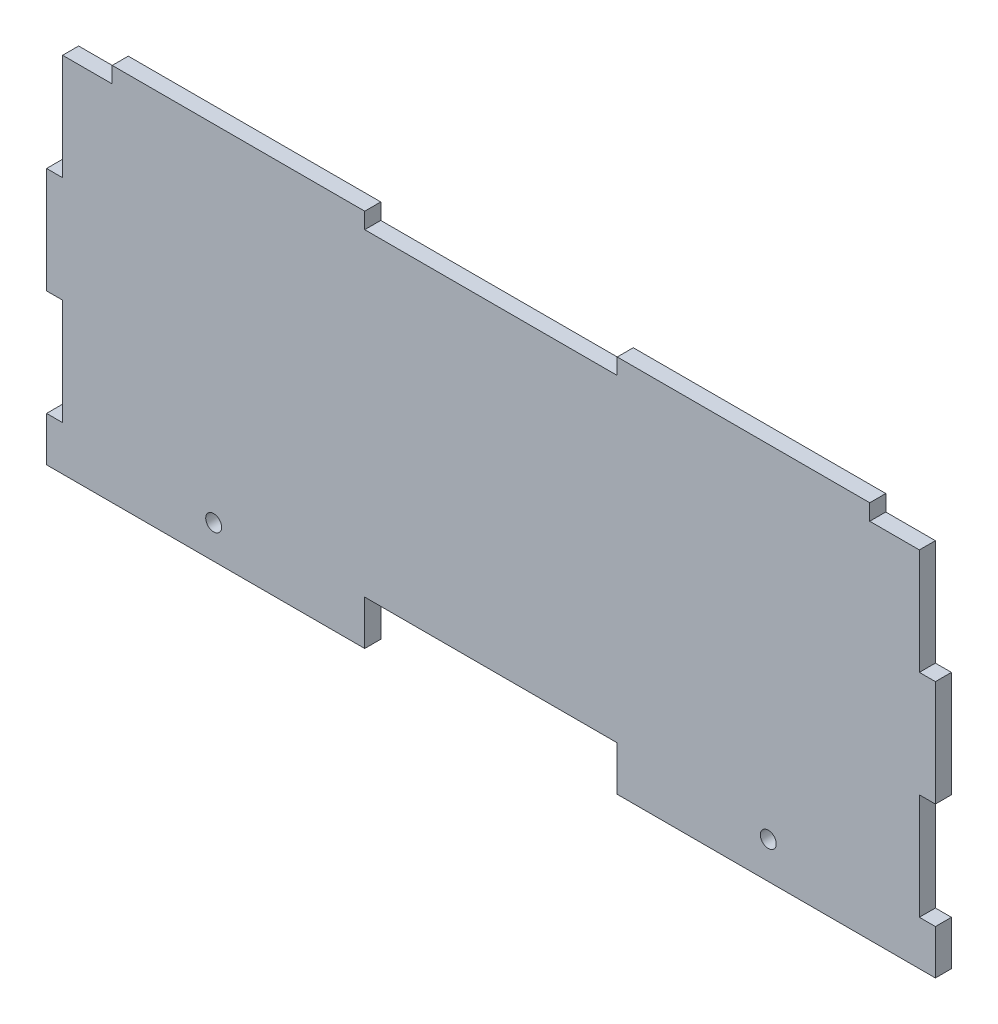
ISO-10303-21;
HEADER;
FILE_DESCRIPTION(('STEP AP214'),'2;1');
FILE_NAME('part.step','',(''),(''),'','','');
FILE_SCHEMA(('AUTOMOTIVE_DESIGN { 1 0 10303 214 1 1 1 1 }'));
ENDSEC;
DATA;
#1=APPLICATION_CONTEXT('core data for automotive mechanical design processes');
#2=APPLICATION_PROTOCOL_DEFINITION('international standard','automotive_design',2000,#1);
#3=PRODUCT_CONTEXT('',#1,'mechanical');
#4=PRODUCT('Part','Part','',(#3));
#5=PRODUCT_RELATED_PRODUCT_CATEGORY('part','',(#4));
#6=PRODUCT_DEFINITION_FORMATION('','',#4);
#7=PRODUCT_DEFINITION_CONTEXT('part definition',#1,'design');
#8=PRODUCT_DEFINITION('design','',#6,#7);
#9=PRODUCT_DEFINITION_SHAPE('','',#8);
#10=(LENGTH_UNIT() NAMED_UNIT(*) SI_UNIT(.MILLI.,.METRE.));
#11=(NAMED_UNIT(*) PLANE_ANGLE_UNIT() SI_UNIT($,.RADIAN.));
#12=(NAMED_UNIT(*) SI_UNIT($,.STERADIAN.) SOLID_ANGLE_UNIT());
#13=UNCERTAINTY_MEASURE_WITH_UNIT(LENGTH_MEASURE(1.E-05),#10,'distance_accuracy_value','');
#14=(GEOMETRIC_REPRESENTATION_CONTEXT(3) GLOBAL_UNCERTAINTY_ASSIGNED_CONTEXT((#13)) GLOBAL_UNIT_ASSIGNED_CONTEXT((#10,
#11,#12)) REPRESENTATION_CONTEXT('',''));
#15=CARTESIAN_POINT('',(0.,0.,0.));
#16=DIRECTION('',(0.,0.,1.));
#17=DIRECTION('',(1.,0.,0.));
#18=AXIS2_PLACEMENT_3D('',#15,#16,#17);
#19=CARTESIAN_POINT('',(172.825,0.,1.5875));
#20=DIRECTION('',(1.,0.,0.));
#21=DIRECTION('',(0.,0.,-1.));
#22=AXIS2_PLACEMENT_3D('',#19,#20,#21);
#23=PLANE('',#22);
#24=DIRECTION('',(0.,-1.,0.));
#25=VECTOR('',#24,1.);
#26=CARTESIAN_POINT('',(172.825,0.,-1.5875));
#27=LINE('',#26,#25);
#28=CARTESIAN_POINT('',(172.825,29.825,-1.5875));
#29=VERTEX_POINT('',#28);
#30=CARTESIAN_POINT('',(172.825,8.82499999999999,-1.5875));
#31=VERTEX_POINT('',#30);
#32=EDGE_CURVE('E343',#29,#31,#27,.T.);
#33=ORIENTED_EDGE('',*,*,#32,.F.);
#34=DIRECTION('',(0.,0.,-1.));
#35=VECTOR('',#34,1.);
#36=CARTESIAN_POINT('',(172.825,29.825,1.5875));
#37=LINE('',#36,#35);
#38=CARTESIAN_POINT('',(172.825,29.825,1.5875));
#39=VERTEX_POINT('',#38);
#40=EDGE_CURVE('E11',#39,#29,#37,.T.);
#41=ORIENTED_EDGE('',*,*,#40,.F.);
#42=DIRECTION('',(0.,-1.,0.));
#43=VECTOR('',#42,1.);
#44=CARTESIAN_POINT('',(172.825,0.,1.5875));
#45=LINE('',#44,#43);
#46=CARTESIAN_POINT('',(172.825,8.82499999999999,1.5875));
#47=VERTEX_POINT('',#46);
#48=EDGE_CURVE('E259',#39,#47,#45,.T.);
#49=ORIENTED_EDGE('',*,*,#48,.T.);
#50=DIRECTION('',(0.,0.,-1.));
#51=VECTOR('',#50,1.);
#52=CARTESIAN_POINT('',(172.825,8.82499999999999,1.5875));
#53=LINE('',#52,#51);
#54=EDGE_CURVE('E146',#47,#31,#53,.T.);
#55=ORIENTED_EDGE('',*,*,#54,.T.);
#56=EDGE_LOOP('',(#33,#41,#49,#55));
#57=FACE_BOUND('',#56,.T.);
#58=ADVANCED_FACE('F35',(#57),#23,.T.);
#59=CARTESIAN_POINT('',(0.,29.825,1.5875));
#60=DIRECTION('',(0.,1.,0.));
#61=DIRECTION('',(0.,0.,1.));
#62=AXIS2_PLACEMENT_3D('',#59,#60,#61);
#63=PLANE('',#62);
#64=DIRECTION('',(1.,0.,0.));
#65=VECTOR('',#64,1.);
#66=CARTESIAN_POINT('',(0.,29.825,-1.5875));
#67=LINE('',#66,#65);
#68=CARTESIAN_POINT('',(176.,29.825,-1.5875));
#69=VERTEX_POINT('',#68);
#70=EDGE_CURVE('E340',#29,#69,#67,.T.);
#71=ORIENTED_EDGE('',*,*,#70,.T.);
#72=DIRECTION('',(0.,0.,-1.));
#73=VECTOR('',#72,1.);
#74=CARTESIAN_POINT('',(176.,29.825,1.5875));
#75=LINE('',#74,#73);
#76=CARTESIAN_POINT('',(176.,29.825,1.5875));
#77=VERTEX_POINT('',#76);
#78=EDGE_CURVE('E44',#77,#69,#75,.T.);
#79=ORIENTED_EDGE('',*,*,#78,.F.);
#80=DIRECTION('',(1.,0.,0.));
#81=VECTOR('',#80,1.);
#82=CARTESIAN_POINT('',(0.,29.825,1.5875));
#83=LINE('',#82,#81);
#84=EDGE_CURVE('E254',#39,#77,#83,.T.);
#85=ORIENTED_EDGE('',*,*,#84,.F.);
#86=ORIENTED_EDGE('',*,*,#40,.T.);
#87=EDGE_LOOP('',(#71,#79,#85,#86));
#88=FACE_BOUND('',#87,.T.);
#89=ADVANCED_FACE('F341',(#88),#63,.F.);
#90=CARTESIAN_POINT('',(176.,0.,1.5875));
#91=DIRECTION('',(1.,0.,0.));
#92=DIRECTION('',(0.,0.,-1.));
#93=AXIS2_PLACEMENT_3D('',#90,#91,#92);
#94=PLANE('',#93);
#95=DIRECTION('',(0.,-1.,0.));
#96=VECTOR('',#95,1.);
#97=CARTESIAN_POINT('',(176.,0.,-1.5875));
#98=LINE('',#97,#96);
#99=CARTESIAN_POINT('',(176.,50.825,-1.5875));
#100=VERTEX_POINT('',#99);
#101=EDGE_CURVE('E275',#100,#69,#98,.T.);
#102=ORIENTED_EDGE('',*,*,#101,.F.);
#103=DIRECTION('',(0.,0.,-1.));
#104=VECTOR('',#103,1.);
#105=CARTESIAN_POINT('',(176.,50.825,1.5875));
#106=LINE('',#105,#104);
#107=CARTESIAN_POINT('',(176.,50.825,1.5875));
#108=VERTEX_POINT('',#107);
#109=EDGE_CURVE('E332',#108,#100,#106,.T.);
#110=ORIENTED_EDGE('',*,*,#109,.F.);
#111=DIRECTION('',(0.,-1.,0.));
#112=VECTOR('',#111,1.);
#113=CARTESIAN_POINT('',(176.,0.,1.5875));
#114=LINE('',#113,#112);
#115=EDGE_CURVE('E248',#108,#77,#114,.T.);
#116=ORIENTED_EDGE('',*,*,#115,.T.);
#117=ORIENTED_EDGE('',*,*,#78,.T.);
#118=EDGE_LOOP('',(#102,#110,#116,#117));
#119=FACE_BOUND('',#118,.T.);
#120=ADVANCED_FACE('F335',(#119),#94,.T.);
#121=CARTESIAN_POINT('',(0.,50.825,1.5875));
#122=DIRECTION('',(0.,1.,0.));
#123=DIRECTION('',(0.,0.,1.));
#124=AXIS2_PLACEMENT_3D('',#121,#122,#123);
#125=PLANE('',#124);
#126=DIRECTION('',(1.,0.,0.));
#127=VECTOR('',#126,1.);
#128=CARTESIAN_POINT('',(0.,50.825,-1.5875));
#129=LINE('',#128,#127);
#130=CARTESIAN_POINT('',(172.825,50.825,-1.5875));
#131=VERTEX_POINT('',#130);
#132=EDGE_CURVE('E348',#131,#100,#129,.T.);
#133=ORIENTED_EDGE('',*,*,#132,.F.);
#134=DIRECTION('',(0.,0.,-1.));
#135=VECTOR('',#134,1.);
#136=CARTESIAN_POINT('',(172.825,50.825,1.5875));
#137=LINE('',#136,#135);
#138=CARTESIAN_POINT('',(172.825,50.825,1.5875));
#139=VERTEX_POINT('',#138);
#140=EDGE_CURVE('E330',#139,#131,#137,.T.);
#141=ORIENTED_EDGE('',*,*,#140,.F.);
#142=DIRECTION('',(1.,0.,0.));
#143=VECTOR('',#142,1.);
#144=CARTESIAN_POINT('',(0.,50.825,1.5875));
#145=LINE('',#144,#143);
#146=EDGE_CURVE('E253',#139,#108,#145,.T.);
#147=ORIENTED_EDGE('',*,*,#146,.T.);
#148=ORIENTED_EDGE('',*,*,#109,.T.);
#149=EDGE_LOOP('',(#133,#141,#147,#148));
#150=FACE_BOUND('',#149,.T.);
#151=ADVANCED_FACE('F517',(#150),#125,.T.);
#152=CARTESIAN_POINT('',(172.825,0.,1.5875));
#153=DIRECTION('',(-1.,0.,0.));
#154=DIRECTION('',(0.,0.,1.));
#155=AXIS2_PLACEMENT_3D('',#152,#153,#154);
#156=PLANE('',#155);
#157=DIRECTION('',(0.,1.,0.));
#158=VECTOR('',#157,1.);
#159=CARTESIAN_POINT('',(172.825,0.,-1.5875));
#160=LINE('',#159,#158);
#161=CARTESIAN_POINT('',(172.825,71.825,-1.5875));
#162=VERTEX_POINT('',#161);
#163=EDGE_CURVE('E349',#131,#162,#160,.T.);
#164=ORIENTED_EDGE('',*,*,#163,.T.);
#165=DIRECTION('',(0.,0.,-1.));
#166=VECTOR('',#165,1.);
#167=CARTESIAN_POINT('',(172.825,71.825,1.5875));
#168=LINE('',#167,#166);
#169=CARTESIAN_POINT('',(172.825,71.825,1.5875));
#170=VERTEX_POINT('',#169);
#171=EDGE_CURVE('E327',#170,#162,#168,.T.);
#172=ORIENTED_EDGE('',*,*,#171,.F.);
#173=DIRECTION('',(0.,1.,0.));
#174=VECTOR('',#173,1.);
#175=CARTESIAN_POINT('',(172.825,0.,1.5875));
#176=LINE('',#175,#174);
#177=EDGE_CURVE('E258',#139,#170,#176,.T.);
#178=ORIENTED_EDGE('',*,*,#177,.F.);
#179=ORIENTED_EDGE('',*,*,#140,.T.);
#180=EDGE_LOOP('',(#164,#172,#178,#179));
#181=FACE_BOUND('',#180,.T.);
#182=ADVANCED_FACE('F514',(#181),#156,.F.);
#183=CARTESIAN_POINT('',(0.,71.825,1.5875));
#184=DIRECTION('',(0.,-1.,0.));
#185=DIRECTION('',(0.,0.,-1.));
#186=AXIS2_PLACEMENT_3D('',#183,#184,#185);
#187=PLANE('',#186);
#188=DIRECTION('',(-1.,0.,0.));
#189=VECTOR('',#188,1.);
#190=CARTESIAN_POINT('',(0.,71.825,-1.5875));
#191=LINE('',#190,#189);
#192=CARTESIAN_POINT('',(163.,71.825,-1.5875));
#193=VERTEX_POINT('',#192);
#194=EDGE_CURVE('E355',#162,#193,#191,.T.);
#195=ORIENTED_EDGE('',*,*,#194,.T.);
#196=DIRECTION('',(0.,0.,-1.));
#197=VECTOR('',#196,1.);
#198=CARTESIAN_POINT('',(163.,71.825,1.5875));
#199=LINE('',#198,#197);
#200=CARTESIAN_POINT('',(163.,71.825,1.5875));
#201=VERTEX_POINT('',#200);
#202=EDGE_CURVE('E325',#201,#193,#199,.T.);
#203=ORIENTED_EDGE('',*,*,#202,.F.);
#204=DIRECTION('',(-1.,0.,0.));
#205=VECTOR('',#204,1.);
#206=CARTESIAN_POINT('',(0.,71.825,1.5875));
#207=LINE('',#206,#205);
#208=EDGE_CURVE('E510',#170,#201,#207,.T.);
#209=ORIENTED_EDGE('',*,*,#208,.F.);
#210=ORIENTED_EDGE('',*,*,#171,.T.);
#211=EDGE_LOOP('',(#195,#203,#209,#210));
#212=FACE_BOUND('',#211,.T.);
#213=ADVANCED_FACE('F509',(#212),#187,.F.);
#214=CARTESIAN_POINT('',(163.,0.,1.5875));
#215=DIRECTION('',(1.,0.,0.));
#216=DIRECTION('',(0.,0.,-1.));
#217=AXIS2_PLACEMENT_3D('',#214,#215,#216);
#218=PLANE('',#217);
#219=DIRECTION('',(0.,-1.,0.));
#220=VECTOR('',#219,1.);
#221=CARTESIAN_POINT('',(163.,0.,-1.5875));
#222=LINE('',#221,#220);
#223=CARTESIAN_POINT('',(163.,75.,-1.5875));
#224=VERTEX_POINT('',#223);
#225=EDGE_CURVE('E358',#224,#193,#222,.T.);
#226=ORIENTED_EDGE('',*,*,#225,.F.);
#227=DIRECTION('',(0.,0.,-1.));
#228=VECTOR('',#227,1.);
#229=CARTESIAN_POINT('',(163.,75.,1.5875));
#230=LINE('',#229,#228);
#231=CARTESIAN_POINT('',(163.,75.,1.5875));
#232=VERTEX_POINT('',#231);
#233=EDGE_CURVE('E323',#232,#224,#230,.T.);
#234=ORIENTED_EDGE('',*,*,#233,.F.);
#235=DIRECTION('',(0.,-1.,0.));
#236=VECTOR('',#235,1.);
#237=CARTESIAN_POINT('',(163.,0.,1.5875));
#238=LINE('',#237,#236);
#239=EDGE_CURVE('E505',#232,#201,#238,.T.);
#240=ORIENTED_EDGE('',*,*,#239,.T.);
#241=ORIENTED_EDGE('',*,*,#202,.T.);
#242=EDGE_LOOP('',(#226,#234,#240,#241));
#243=FACE_BOUND('',#242,.T.);
#244=ADVANCED_FACE('F504',(#243),#218,.T.);
#245=CARTESIAN_POINT('',(0.,75.,1.5875));
#246=DIRECTION('',(0.,-1.,0.));
#247=DIRECTION('',(1.,0.,0.));
#248=AXIS2_PLACEMENT_3D('',#245,#246,#247);
#249=PLANE('',#248);
#250=DIRECTION('',(-1.,0.,0.));
#251=VECTOR('',#250,1.);
#252=CARTESIAN_POINT('',(0.,75.,-1.5875));
#253=LINE('',#252,#251);
#254=CARTESIAN_POINT('',(113.,75.,-1.5875));
#255=VERTEX_POINT('',#254);
#256=EDGE_CURVE('E361',#224,#255,#253,.T.);
#257=ORIENTED_EDGE('',*,*,#256,.T.);
#258=DIRECTION('',(0.,0.,-1.));
#259=VECTOR('',#258,1.);
#260=CARTESIAN_POINT('',(113.,75.,1.5875));
#261=LINE('',#260,#259);
#262=CARTESIAN_POINT('',(113.,75.,1.5875));
#263=VERTEX_POINT('',#262);
#264=EDGE_CURVE('E321',#263,#255,#261,.T.);
#265=ORIENTED_EDGE('',*,*,#264,.F.);
#266=DIRECTION('',(-1.,0.,0.));
#267=VECTOR('',#266,1.);
#268=CARTESIAN_POINT('',(0.,75.,1.5875));
#269=LINE('',#268,#267);
#270=EDGE_CURVE('E500',#232,#263,#269,.T.);
#271=ORIENTED_EDGE('',*,*,#270,.F.);
#272=ORIENTED_EDGE('',*,*,#233,.T.);
#273=EDGE_LOOP('',(#257,#265,#271,#272));
#274=FACE_BOUND('',#273,.T.);
#275=ADVANCED_FACE('F499',(#274),#249,.F.);
#276=CARTESIAN_POINT('',(113.,0.,1.5875));
#277=DIRECTION('',(-1.,0.,0.));
#278=DIRECTION('',(0.,0.,1.));
#279=AXIS2_PLACEMENT_3D('',#276,#277,#278);
#280=PLANE('',#279);
#281=DIRECTION('',(0.,1.,0.));
#282=VECTOR('',#281,1.);
#283=CARTESIAN_POINT('',(113.,0.,-1.5875));
#284=LINE('',#283,#282);
#285=CARTESIAN_POINT('',(113.,71.825,-1.5875));
#286=VERTEX_POINT('',#285);
#287=EDGE_CURVE('E364',#286,#255,#284,.T.);
#288=ORIENTED_EDGE('',*,*,#287,.F.);
#289=DIRECTION('',(0.,0.,-1.));
#290=VECTOR('',#289,1.);
#291=CARTESIAN_POINT('',(113.,71.825,1.5875));
#292=LINE('',#291,#290);
#293=CARTESIAN_POINT('',(113.,71.825,1.5875));
#294=VERTEX_POINT('',#293);
#295=EDGE_CURVE('E319',#294,#286,#292,.T.);
#296=ORIENTED_EDGE('',*,*,#295,.F.);
#297=DIRECTION('',(0.,1.,0.));
#298=VECTOR('',#297,1.);
#299=CARTESIAN_POINT('',(113.,0.,1.5875));
#300=LINE('',#299,#298);
#301=EDGE_CURVE('E496',#294,#263,#300,.T.);
#302=ORIENTED_EDGE('',*,*,#301,.T.);
#303=ORIENTED_EDGE('',*,*,#264,.T.);
#304=EDGE_LOOP('',(#288,#296,#302,#303));
#305=FACE_BOUND('',#304,.T.);
#306=ADVANCED_FACE('F492',(#305),#280,.T.);
#307=CARTESIAN_POINT('',(0.,71.825,1.5875));
#308=DIRECTION('',(0.,1.,0.));
#309=DIRECTION('',(0.,0.,1.));
#310=AXIS2_PLACEMENT_3D('',#307,#308,#309);
#311=PLANE('',#310);
#312=DIRECTION('',(1.,0.,0.));
#313=VECTOR('',#312,1.);
#314=CARTESIAN_POINT('',(0.,71.825,-1.5875));
#315=LINE('',#314,#313);
#316=CARTESIAN_POINT('',(63.,71.825,-1.5875));
#317=VERTEX_POINT('',#316);
#318=EDGE_CURVE('E368',#317,#286,#315,.T.);
#319=ORIENTED_EDGE('',*,*,#318,.F.);
#320=DIRECTION('',(0.,0.,-1.));
#321=VECTOR('',#320,1.);
#322=CARTESIAN_POINT('',(63.,71.825,1.5875));
#323=LINE('',#322,#321);
#324=CARTESIAN_POINT('',(63.,71.825,1.5875));
#325=VERTEX_POINT('',#324);
#326=EDGE_CURVE('E317',#325,#317,#323,.T.);
#327=ORIENTED_EDGE('',*,*,#326,.F.);
#328=DIRECTION('',(1.,0.,0.));
#329=VECTOR('',#328,1.);
#330=CARTESIAN_POINT('',(0.,71.825,1.5875));
#331=LINE('',#330,#329);
#332=EDGE_CURVE('E525',#325,#294,#331,.T.);
#333=ORIENTED_EDGE('',*,*,#332,.T.);
#334=ORIENTED_EDGE('',*,*,#295,.T.);
#335=EDGE_LOOP('',(#319,#327,#333,#334));
#336=FACE_BOUND('',#335,.T.);
#337=ADVANCED_FACE('F487',(#336),#311,.T.);
#338=CARTESIAN_POINT('',(63.,0.,1.5875));
#339=DIRECTION('',(1.,0.,0.));
#340=DIRECTION('',(0.,0.,-1.));
#341=AXIS2_PLACEMENT_3D('',#338,#339,#340);
#342=PLANE('',#341);
#343=DIRECTION('',(0.,-1.,0.));
#344=VECTOR('',#343,1.);
#345=CARTESIAN_POINT('',(63.,0.,-1.5875));
#346=LINE('',#345,#344);
#347=CARTESIAN_POINT('',(63.,75.,-1.5875));
#348=VERTEX_POINT('',#347);
#349=EDGE_CURVE('E371',#348,#317,#346,.T.);
#350=ORIENTED_EDGE('',*,*,#349,.F.);
#351=DIRECTION('',(0.,0.,-1.));
#352=VECTOR('',#351,1.);
#353=CARTESIAN_POINT('',(63.,75.,1.5875));
#354=LINE('',#353,#352);
#355=CARTESIAN_POINT('',(63.,75.,1.5875));
#356=VERTEX_POINT('',#355);
#357=EDGE_CURVE('E315',#356,#348,#354,.T.);
#358=ORIENTED_EDGE('',*,*,#357,.F.);
#359=DIRECTION('',(0.,-1.,0.));
#360=VECTOR('',#359,1.);
#361=CARTESIAN_POINT('',(63.,0.,1.5875));
#362=LINE('',#361,#360);
#363=EDGE_CURVE('E483',#356,#325,#362,.T.);
#364=ORIENTED_EDGE('',*,*,#363,.T.);
#365=ORIENTED_EDGE('',*,*,#326,.T.);
#366=EDGE_LOOP('',(#350,#358,#364,#365));
#367=FACE_BOUND('',#366,.T.);
#368=ADVANCED_FACE('F479',(#367),#342,.T.);
#369=CARTESIAN_POINT('',(13.,75.,-1.5875));
#370=VERTEX_POINT('',#369);
#371=EDGE_CURVE('E365',#348,#370,#253,.T.);
#372=ORIENTED_EDGE('',*,*,#371,.T.);
#373=DIRECTION('',(0.,0.,-1.));
#374=VECTOR('',#373,1.);
#375=CARTESIAN_POINT('',(13.,75.,1.5875));
#376=LINE('',#375,#374);
#377=CARTESIAN_POINT('',(13.,75.,1.5875));
#378=VERTEX_POINT('',#377);
#379=EDGE_CURVE('E312',#378,#370,#376,.T.);
#380=ORIENTED_EDGE('',*,*,#379,.F.);
#381=EDGE_CURVE('E523',#356,#378,#269,.T.);
#382=ORIENTED_EDGE('',*,*,#381,.F.);
#383=ORIENTED_EDGE('',*,*,#357,.T.);
#384=EDGE_LOOP('',(#372,#380,#382,#383));
#385=FACE_BOUND('',#384,.T.);
#386=ADVANCED_FACE('F476',(#385),#249,.F.);
#387=CARTESIAN_POINT('',(13.,0.,1.5875));
#388=DIRECTION('',(1.,0.,0.));
#389=DIRECTION('',(0.,1.,0.));
#390=AXIS2_PLACEMENT_3D('',#387,#388,#389);
#391=PLANE('',#390);
#392=DIRECTION('',(0.,-1.,0.));
#393=VECTOR('',#392,1.);
#394=CARTESIAN_POINT('',(13.,0.,-1.5875));
#395=LINE('',#394,#393);
#396=CARTESIAN_POINT('',(13.,71.825,-1.5875));
#397=VERTEX_POINT('',#396);
#398=EDGE_CURVE('E374',#370,#397,#395,.T.);
#399=ORIENTED_EDGE('',*,*,#398,.T.);
#400=DIRECTION('',(0.,0.,-1.));
#401=VECTOR('',#400,1.);
#402=CARTESIAN_POINT('',(13.,71.825,1.5875));
#403=LINE('',#402,#401);
#404=CARTESIAN_POINT('',(13.,71.825,1.5875));
#405=VERTEX_POINT('',#404);
#406=EDGE_CURVE('E310',#405,#397,#403,.T.);
#407=ORIENTED_EDGE('',*,*,#406,.F.);
#408=DIRECTION('',(0.,-1.,0.));
#409=VECTOR('',#408,1.);
#410=CARTESIAN_POINT('',(13.,0.,1.5875));
#411=LINE('',#410,#409);
#412=EDGE_CURVE('E472',#378,#405,#411,.T.);
#413=ORIENTED_EDGE('',*,*,#412,.F.);
#414=ORIENTED_EDGE('',*,*,#379,.T.);
#415=EDGE_LOOP('',(#399,#407,#413,#414));
#416=FACE_BOUND('',#415,.T.);
#417=ADVANCED_FACE('F469',(#416),#391,.F.);
#418=CARTESIAN_POINT('',(0.,71.825,1.5875));
#419=DIRECTION('',(0.,1.,0.));
#420=DIRECTION('',(0.,0.,1.));
#421=AXIS2_PLACEMENT_3D('',#418,#419,#420);
#422=PLANE('',#421);
#423=DIRECTION('',(1.,0.,0.));
#424=VECTOR('',#423,1.);
#425=CARTESIAN_POINT('',(0.,71.825,-1.5875));
#426=LINE('',#425,#424);
#427=CARTESIAN_POINT('',(3.175,71.825,-1.5875));
#428=VERTEX_POINT('',#427);
#429=EDGE_CURVE('E377',#428,#397,#426,.T.);
#430=ORIENTED_EDGE('',*,*,#429,.F.);
#431=DIRECTION('',(0.,0.,-1.));
#432=VECTOR('',#431,1.);
#433=CARTESIAN_POINT('',(3.175,71.825,1.5875));
#434=LINE('',#433,#432);
#435=CARTESIAN_POINT('',(3.175,71.825,1.5875));
#436=VERTEX_POINT('',#435);
#437=EDGE_CURVE('E308',#436,#428,#434,.T.);
#438=ORIENTED_EDGE('',*,*,#437,.F.);
#439=DIRECTION('',(1.,0.,0.));
#440=VECTOR('',#439,1.);
#441=CARTESIAN_POINT('',(0.,71.825,1.5875));
#442=LINE('',#441,#440);
#443=EDGE_CURVE('E467',#436,#405,#442,.T.);
#444=ORIENTED_EDGE('',*,*,#443,.T.);
#445=ORIENTED_EDGE('',*,*,#406,.T.);
#446=EDGE_LOOP('',(#430,#438,#444,#445));
#447=FACE_BOUND('',#446,.T.);
#448=ADVANCED_FACE('F463',(#447),#422,.T.);
#449=CARTESIAN_POINT('',(3.17500000000001,0.,1.5875));
#450=DIRECTION('',(-1.,0.,0.));
#451=DIRECTION('',(0.,-1.,0.));
#452=AXIS2_PLACEMENT_3D('',#449,#450,#451);
#453=PLANE('',#452);
#454=DIRECTION('',(0.,1.,0.));
#455=VECTOR('',#454,1.);
#456=CARTESIAN_POINT('',(3.17500000000001,0.,-1.5875));
#457=LINE('',#456,#455);
#458=CARTESIAN_POINT('',(3.175,50.825,-1.5875));
#459=VERTEX_POINT('',#458);
#460=EDGE_CURVE('E380',#459,#428,#457,.T.);
#461=ORIENTED_EDGE('',*,*,#460,.F.);
#462=DIRECTION('',(0.,0.,-1.));
#463=VECTOR('',#462,1.);
#464=CARTESIAN_POINT('',(3.175,50.825,1.5875));
#465=LINE('',#464,#463);
#466=CARTESIAN_POINT('',(3.175,50.825,1.5875));
#467=VERTEX_POINT('',#466);
#468=EDGE_CURVE('E306',#467,#459,#465,.T.);
#469=ORIENTED_EDGE('',*,*,#468,.F.);
#470=DIRECTION('',(0.,1.,0.));
#471=VECTOR('',#470,1.);
#472=CARTESIAN_POINT('',(3.17500000000001,0.,1.5875));
#473=LINE('',#472,#471);
#474=EDGE_CURVE('E530',#467,#436,#473,.T.);
#475=ORIENTED_EDGE('',*,*,#474,.T.);
#476=ORIENTED_EDGE('',*,*,#437,.T.);
#477=EDGE_LOOP('',(#461,#469,#475,#476));
#478=FACE_BOUND('',#477,.T.);
#479=ADVANCED_FACE('F459',(#478),#453,.T.);
#480=CARTESIAN_POINT('',(0.,50.825,1.5875));
#481=DIRECTION('',(0.,1.,0.));
#482=DIRECTION('',(0.,0.,1.));
#483=AXIS2_PLACEMENT_3D('',#480,#481,#482);
#484=PLANE('',#483);
#485=DIRECTION('',(1.,0.,0.));
#486=VECTOR('',#485,1.);
#487=CARTESIAN_POINT('',(0.,50.825,-1.5875));
#488=LINE('',#487,#486);
#489=CARTESIAN_POINT('',(0.,50.825,-1.5875));
#490=VERTEX_POINT('',#489);
#491=EDGE_CURVE('E383',#490,#459,#488,.T.);
#492=ORIENTED_EDGE('',*,*,#491,.F.);
#493=DIRECTION('',(0.,0.,-1.));
#494=VECTOR('',#493,1.);
#495=CARTESIAN_POINT('',(0.,50.825,1.5875));
#496=LINE('',#495,#494);
#497=CARTESIAN_POINT('',(0.,50.825,1.5875));
#498=VERTEX_POINT('',#497);
#499=EDGE_CURVE('E304',#498,#490,#496,.T.);
#500=ORIENTED_EDGE('',*,*,#499,.F.);
#501=DIRECTION('',(1.,0.,0.));
#502=VECTOR('',#501,1.);
#503=CARTESIAN_POINT('',(0.,50.825,1.5875));
#504=LINE('',#503,#502);
#505=EDGE_CURVE('E455',#498,#467,#504,.T.);
#506=ORIENTED_EDGE('',*,*,#505,.T.);
#507=ORIENTED_EDGE('',*,*,#468,.T.);
#508=EDGE_LOOP('',(#492,#500,#506,#507));
#509=FACE_BOUND('',#508,.T.);
#510=ADVANCED_FACE('F451',(#509),#484,.T.);
#511=CARTESIAN_POINT('',(0.,0.,1.5875));
#512=DIRECTION('',(1.,0.,0.));
#513=DIRECTION('',(0.,0.,-1.));
#514=AXIS2_PLACEMENT_3D('',#511,#512,#513);
#515=PLANE('',#514);
#516=DIRECTION('',(0.,-1.,0.));
#517=VECTOR('',#516,1.);
#518=CARTESIAN_POINT('',(0.,0.,-1.5875));
#519=LINE('',#518,#517);
#520=CARTESIAN_POINT('',(0.,29.825,-1.5875));
#521=VERTEX_POINT('',#520);
#522=EDGE_CURVE('E386',#490,#521,#519,.T.);
#523=ORIENTED_EDGE('',*,*,#522,.T.);
#524=DIRECTION('',(0.,0.,-1.));
#525=VECTOR('',#524,1.);
#526=CARTESIAN_POINT('',(0.,29.825,1.5875));
#527=LINE('',#526,#525);
#528=CARTESIAN_POINT('',(0.,29.825,1.5875));
#529=VERTEX_POINT('',#528);
#530=EDGE_CURVE('E301',#529,#521,#527,.T.);
#531=ORIENTED_EDGE('',*,*,#530,.F.);
#532=DIRECTION('',(0.,-1.,0.));
#533=VECTOR('',#532,1.);
#534=CARTESIAN_POINT('',(0.,0.,1.5875));
#535=LINE('',#534,#533);
#536=EDGE_CURVE('E533',#498,#529,#535,.T.);
#537=ORIENTED_EDGE('',*,*,#536,.F.);
#538=ORIENTED_EDGE('',*,*,#499,.T.);
#539=EDGE_LOOP('',(#523,#531,#537,#538));
#540=FACE_BOUND('',#539,.T.);
#541=ADVANCED_FACE('F448',(#540),#515,.F.);
#542=CARTESIAN_POINT('',(0.,29.825,1.5875));
#543=DIRECTION('',(0.,1.,0.));
#544=DIRECTION('',(0.,0.,1.));
#545=AXIS2_PLACEMENT_3D('',#542,#543,#544);
#546=PLANE('',#545);
#547=DIRECTION('',(1.,0.,0.));
#548=VECTOR('',#547,1.);
#549=CARTESIAN_POINT('',(0.,29.825,-1.5875));
#550=LINE('',#549,#548);
#551=CARTESIAN_POINT('',(3.17500000000001,29.825,-1.5875));
#552=VERTEX_POINT('',#551);
#553=EDGE_CURVE('E389',#521,#552,#550,.T.);
#554=ORIENTED_EDGE('',*,*,#553,.T.);
#555=DIRECTION('',(0.,0.,-1.));
#556=VECTOR('',#555,1.);
#557=CARTESIAN_POINT('',(3.17500000000001,29.825,1.5875));
#558=LINE('',#557,#556);
#559=CARTESIAN_POINT('',(3.17500000000001,29.825,1.5875));
#560=VERTEX_POINT('',#559);
#561=EDGE_CURVE('E298',#560,#552,#558,.T.);
#562=ORIENTED_EDGE('',*,*,#561,.F.);
#563=DIRECTION('',(1.,0.,0.));
#564=VECTOR('',#563,1.);
#565=CARTESIAN_POINT('',(0.,29.825,1.5875));
#566=LINE('',#565,#564);
#567=EDGE_CURVE('E444',#529,#560,#566,.T.);
#568=ORIENTED_EDGE('',*,*,#567,.F.);
#569=ORIENTED_EDGE('',*,*,#530,.T.);
#570=EDGE_LOOP('',(#554,#562,#568,#569));
#571=FACE_BOUND('',#570,.T.);
#572=ADVANCED_FACE('F442',(#571),#546,.F.);
#573=CARTESIAN_POINT('',(3.17500000000001,0.,1.5875));
#574=DIRECTION('',(1.,0.,0.));
#575=DIRECTION('',(0.,1.,0.));
#576=AXIS2_PLACEMENT_3D('',#573,#574,#575);
#577=PLANE('',#576);
#578=DIRECTION('',(0.,-1.,0.));
#579=VECTOR('',#578,1.);
#580=CARTESIAN_POINT('',(3.17500000000001,0.,-1.5875));
#581=LINE('',#580,#579);
#582=CARTESIAN_POINT('',(3.17500000000001,8.82499999999999,-1.5875));
#583=VERTEX_POINT('',#582);
#584=EDGE_CURVE('E393',#552,#583,#581,.T.);
#585=ORIENTED_EDGE('',*,*,#584,.T.);
#586=DIRECTION('',(0.,0.,-1.));
#587=VECTOR('',#586,1.);
#588=CARTESIAN_POINT('',(3.17500000000001,8.82499999999999,1.5875));
#589=LINE('',#588,#587);
#590=CARTESIAN_POINT('',(3.17500000000001,8.82499999999999,1.5875));
#591=VERTEX_POINT('',#590);
#592=EDGE_CURVE('E295',#591,#583,#589,.T.);
#593=ORIENTED_EDGE('',*,*,#592,.F.);
#594=DIRECTION('',(0.,-1.,0.));
#595=VECTOR('',#594,1.);
#596=CARTESIAN_POINT('',(3.17500000000001,0.,1.5875));
#597=LINE('',#596,#595);
#598=EDGE_CURVE('E439',#560,#591,#597,.T.);
#599=ORIENTED_EDGE('',*,*,#598,.F.);
#600=ORIENTED_EDGE('',*,*,#561,.T.);
#601=EDGE_LOOP('',(#585,#593,#599,#600));
#602=FACE_BOUND('',#601,.T.);
#603=ADVANCED_FACE('F437',(#602),#577,.F.);
#604=CARTESIAN_POINT('',(0.,8.82499999999997,1.5875));
#605=DIRECTION('',(0.,-1.,0.));
#606=DIRECTION('',(1.,0.,0.));
#607=AXIS2_PLACEMENT_3D('',#604,#605,#606);
#608=PLANE('',#607);
#609=DIRECTION('',(-1.,0.,0.));
#610=VECTOR('',#609,1.);
#611=CARTESIAN_POINT('',(0.,8.82499999999997,-1.5875));
#612=LINE('',#611,#610);
#613=CARTESIAN_POINT('',(0.,8.82499999999998,-1.5875));
#614=VERTEX_POINT('',#613);
#615=EDGE_CURVE('E396',#583,#614,#612,.T.);
#616=ORIENTED_EDGE('',*,*,#615,.T.);
#617=DIRECTION('',(0.,0.,-1.));
#618=VECTOR('',#617,1.);
#619=CARTESIAN_POINT('',(0.,8.82499999999998,1.5875));
#620=LINE('',#619,#618);
#621=CARTESIAN_POINT('',(0.,8.82499999999998,1.5875));
#622=VERTEX_POINT('',#621);
#623=EDGE_CURVE('E292',#622,#614,#620,.T.);
#624=ORIENTED_EDGE('',*,*,#623,.F.);
#625=DIRECTION('',(-1.,0.,0.));
#626=VECTOR('',#625,1.);
#627=CARTESIAN_POINT('',(0.,8.82499999999997,1.5875));
#628=LINE('',#627,#626);
#629=EDGE_CURVE('E537',#591,#622,#628,.T.);
#630=ORIENTED_EDGE('',*,*,#629,.F.);
#631=ORIENTED_EDGE('',*,*,#592,.T.);
#632=EDGE_LOOP('',(#616,#624,#630,#631));
#633=FACE_BOUND('',#632,.T.);
#634=ADVANCED_FACE('F432',(#633),#608,.F.);
#635=CARTESIAN_POINT('',(0.,0.,-1.5875));
#636=VERTEX_POINT('',#635);
#637=EDGE_CURVE('E390',#614,#636,#519,.T.);
#638=ORIENTED_EDGE('',*,*,#637,.T.);
#639=DIRECTION('',(0.,0.,-1.));
#640=VECTOR('',#639,1.);
#641=CARTESIAN_POINT('',(0.,0.,1.5875));
#642=LINE('',#641,#640);
#643=CARTESIAN_POINT('',(0.,0.,1.5875));
#644=VERTEX_POINT('',#643);
#645=EDGE_CURVE('E289',#644,#636,#642,.T.);
#646=ORIENTED_EDGE('',*,*,#645,.F.);
#647=EDGE_CURVE('E429',#622,#644,#535,.T.);
#648=ORIENTED_EDGE('',*,*,#647,.F.);
#649=ORIENTED_EDGE('',*,*,#623,.T.);
#650=EDGE_LOOP('',(#638,#646,#648,#649));
#651=FACE_BOUND('',#650,.T.);
#652=ADVANCED_FACE('F427',(#651),#515,.F.);
#653=CARTESIAN_POINT('',(0.,0.,1.5875));
#654=DIRECTION('',(0.,1.,0.));
#655=DIRECTION('',(-1.,0.,0.));
#656=AXIS2_PLACEMENT_3D('',#653,#654,#655);
#657=PLANE('',#656);
#658=DIRECTION('',(1.,0.,0.));
#659=VECTOR('',#658,1.);
#660=CARTESIAN_POINT('',(0.,0.,-1.5875));
#661=LINE('',#660,#659);
#662=CARTESIAN_POINT('',(63.,0.,-1.5875));
#663=VERTEX_POINT('',#662);
#664=EDGE_CURVE('E399',#636,#663,#661,.T.);
#665=ORIENTED_EDGE('',*,*,#664,.T.);
#666=DIRECTION('',(0.,0.,-1.));
#667=VECTOR('',#666,1.);
#668=CARTESIAN_POINT('',(63.,0.,1.5875));
#669=LINE('',#668,#667);
#670=CARTESIAN_POINT('',(63.,0.,1.5875));
#671=VERTEX_POINT('',#670);
#672=EDGE_CURVE('E287',#671,#663,#669,.T.);
#673=ORIENTED_EDGE('',*,*,#672,.F.);
#674=DIRECTION('',(1.,0.,0.));
#675=VECTOR('',#674,1.);
#676=CARTESIAN_POINT('',(0.,0.,1.5875));
#677=LINE('',#676,#675);
#678=EDGE_CURVE('E236',#644,#671,#677,.T.);
#679=ORIENTED_EDGE('',*,*,#678,.F.);
#680=ORIENTED_EDGE('',*,*,#645,.T.);
#681=EDGE_LOOP('',(#665,#673,#679,#680));
#682=FACE_BOUND('',#681,.T.);
#683=ADVANCED_FACE('F424',(#682),#657,.F.);
#684=CARTESIAN_POINT('',(63.,0.,1.5875));
#685=DIRECTION('',(1.,0.,0.));
#686=DIRECTION('',(0.,0.,-1.));
#687=AXIS2_PLACEMENT_3D('',#684,#685,#686);
#688=PLANE('',#687);
#689=DIRECTION('',(0.,-1.,0.));
#690=VECTOR('',#689,1.);
#691=CARTESIAN_POINT('',(63.,0.,-1.5875));
#692=LINE('',#691,#690);
#693=CARTESIAN_POINT('',(63.,8.82499999999997,-1.5875));
#694=VERTEX_POINT('',#693);
#695=EDGE_CURVE('E402',#694,#663,#692,.T.);
#696=ORIENTED_EDGE('',*,*,#695,.F.);
#697=DIRECTION('',(0.,0.,-1.));
#698=VECTOR('',#697,1.);
#699=CARTESIAN_POINT('',(63.,8.82499999999997,1.5875));
#700=LINE('',#699,#698);
#701=CARTESIAN_POINT('',(63.,8.82499999999997,1.5875));
#702=VERTEX_POINT('',#701);
#703=EDGE_CURVE('E285',#702,#694,#700,.T.);
#704=ORIENTED_EDGE('',*,*,#703,.F.);
#705=DIRECTION('',(0.,-1.,0.));
#706=VECTOR('',#705,1.);
#707=CARTESIAN_POINT('',(63.,0.,1.5875));
#708=LINE('',#707,#706);
#709=EDGE_CURVE('E539',#702,#671,#708,.T.);
#710=ORIENTED_EDGE('',*,*,#709,.T.);
#711=ORIENTED_EDGE('',*,*,#672,.T.);
#712=EDGE_LOOP('',(#696,#704,#710,#711));
#713=FACE_BOUND('',#712,.T.);
#714=ADVANCED_FACE('F419',(#713),#688,.T.);
#715=CARTESIAN_POINT('',(0.,8.82499999999995,1.5875));
#716=DIRECTION('',(0.,-1.,0.));
#717=DIRECTION('',(1.,0.,0.));
#718=AXIS2_PLACEMENT_3D('',#715,#716,#717);
#719=PLANE('',#718);
#720=DIRECTION('',(-1.,0.,0.));
#721=VECTOR('',#720,1.);
#722=CARTESIAN_POINT('',(0.,8.82499999999995,-1.5875));
#723=LINE('',#722,#721);
#724=CARTESIAN_POINT('',(113.,8.82499999999999,-1.5875));
#725=VERTEX_POINT('',#724);
#726=EDGE_CURVE('E404',#725,#694,#723,.T.);
#727=ORIENTED_EDGE('',*,*,#726,.F.);
#728=DIRECTION('',(0.,0.,-1.));
#729=VECTOR('',#728,1.);
#730=CARTESIAN_POINT('',(113.,8.82499999999999,1.5875));
#731=LINE('',#730,#729);
#732=CARTESIAN_POINT('',(113.,8.82499999999999,1.5875));
#733=VERTEX_POINT('',#732);
#734=EDGE_CURVE('E283',#733,#725,#731,.T.);
#735=ORIENTED_EDGE('',*,*,#734,.F.);
#736=DIRECTION('',(-1.,0.,0.));
#737=VECTOR('',#736,1.);
#738=CARTESIAN_POINT('',(0.,8.82499999999995,1.5875));
#739=LINE('',#738,#737);
#740=EDGE_CURVE('E415',#733,#702,#739,.T.);
#741=ORIENTED_EDGE('',*,*,#740,.T.);
#742=ORIENTED_EDGE('',*,*,#703,.T.);
#743=EDGE_LOOP('',(#727,#735,#741,#742));
#744=FACE_BOUND('',#743,.T.);
#745=ADVANCED_FACE('F412',(#744),#719,.T.);
#746=CARTESIAN_POINT('',(113.,-5.33095758283186E-13,1.5875));
#747=DIRECTION('',(1.,0.,0.));
#748=DIRECTION('',(0.,1.,0.));
#749=AXIS2_PLACEMENT_3D('',#746,#747,#748);
#750=PLANE('',#749);
#751=DIRECTION('',(0.,-1.,0.));
#752=VECTOR('',#751,1.);
#753=CARTESIAN_POINT('',(113.,-5.33095758283186E-13,-1.5875));
#754=LINE('',#753,#752);
#755=CARTESIAN_POINT('',(113.,0.,-1.5875));
#756=VERTEX_POINT('',#755);
#757=EDGE_CURVE('E278',#725,#756,#754,.T.);
#758=ORIENTED_EDGE('',*,*,#757,.T.);
#759=DIRECTION('',(0.,0.,-1.));
#760=VECTOR('',#759,1.);
#761=CARTESIAN_POINT('',(113.,0.,1.5875));
#762=LINE('',#761,#760);
#763=CARTESIAN_POINT('',(113.,0.,1.5875));
#764=VERTEX_POINT('',#763);
#765=EDGE_CURVE('E244',#764,#756,#762,.T.);
#766=ORIENTED_EDGE('',*,*,#765,.F.);
#767=DIRECTION('',(0.,-1.,0.));
#768=VECTOR('',#767,1.);
#769=CARTESIAN_POINT('',(113.,-5.33095758283186E-13,1.5875));
#770=LINE('',#769,#768);
#771=EDGE_CURVE('E231',#733,#764,#770,.T.);
#772=ORIENTED_EDGE('',*,*,#771,.F.);
#773=ORIENTED_EDGE('',*,*,#734,.T.);
#774=EDGE_LOOP('',(#758,#766,#772,#773));
#775=FACE_BOUND('',#774,.T.);
#776=ADVANCED_FACE('F410',(#775),#750,.F.);
#777=CARTESIAN_POINT('',(176.,0.,-1.5875));
#778=VERTEX_POINT('',#777);
#779=EDGE_CURVE('E240',#756,#778,#661,.T.);
#780=ORIENTED_EDGE('',*,*,#779,.T.);
#781=DIRECTION('',(0.,0.,-1.));
#782=VECTOR('',#781,1.);
#783=CARTESIAN_POINT('',(176.,0.,1.5875));
#784=LINE('',#783,#782);
#785=CARTESIAN_POINT('',(176.,0.,1.5875));
#786=VERTEX_POINT('',#785);
#787=EDGE_CURVE('E238',#786,#778,#784,.T.);
#788=ORIENTED_EDGE('',*,*,#787,.F.);
#789=EDGE_CURVE('E224',#764,#786,#677,.T.);
#790=ORIENTED_EDGE('',*,*,#789,.F.);
#791=ORIENTED_EDGE('',*,*,#765,.T.);
#792=EDGE_LOOP('',(#780,#788,#790,#791));
#793=FACE_BOUND('',#792,.T.);
#794=ADVANCED_FACE('F239',(#793),#657,.F.);
#795=CARTESIAN_POINT('',(176.,8.82499999999999,-1.5875));
#796=VERTEX_POINT('',#795);
#797=EDGE_CURVE('E271',#796,#778,#98,.T.);
#798=ORIENTED_EDGE('',*,*,#797,.F.);
#799=DIRECTION('',(0.,0.,-1.));
#800=VECTOR('',#799,1.);
#801=CARTESIAN_POINT('',(176.,8.82499999999999,1.5875));
#802=LINE('',#801,#800);
#803=CARTESIAN_POINT('',(176.,8.82499999999999,1.5875));
#804=VERTEX_POINT('',#803);
#805=EDGE_CURVE('E139',#804,#796,#802,.T.);
#806=ORIENTED_EDGE('',*,*,#805,.F.);
#807=EDGE_CURVE('E228',#804,#786,#114,.T.);
#808=ORIENTED_EDGE('',*,*,#807,.T.);
#809=ORIENTED_EDGE('',*,*,#787,.T.);
#810=EDGE_LOOP('',(#798,#806,#808,#809));
#811=FACE_BOUND('',#810,.T.);
#812=ADVANCED_FACE('F246',(#811),#94,.T.);
#813=CARTESIAN_POINT('',(33.0875,6.61874999999999,1.5875));
#814=DIRECTION('',(0.,0.,-1.));
#815=DIRECTION('',(-1.,0.,0.));
#816=AXIS2_PLACEMENT_3D('',#813,#814,#815);
#817=CYLINDRICAL_SURFACE('',#816,1.575);
#818=CARTESIAN_POINT('',(33.0875,6.61874999999999,1.5875));
#819=DIRECTION('',(0.,0.,1.));
#820=DIRECTION('',(1.,0.,0.));
#821=AXIS2_PLACEMENT_3D('',#818,#819,#820);
#822=CIRCLE('',#821,1.575);
#823=CARTESIAN_POINT('',(34.6625,6.61874999999999,1.5875));
#824=VERTEX_POINT('',#823);
#825=EDGE_CURVE('E261',#824,#824,#822,.T.);
#826=ORIENTED_EDGE('',*,*,#825,.T.);
#827=EDGE_LOOP('',(#826));
#828=FACE_BOUND('',#827,.T.);
#829=CARTESIAN_POINT('',(33.0875,6.61874999999999,-1.5875));
#830=DIRECTION('',(0.,0.,1.));
#831=DIRECTION('',(1.,0.,0.));
#832=AXIS2_PLACEMENT_3D('',#829,#830,#831);
#833=CIRCLE('',#832,1.575);
#834=CARTESIAN_POINT('',(34.6625,6.61874999999999,-1.5875));
#835=VERTEX_POINT('',#834);
#836=EDGE_CURVE('E546',#835,#835,#833,.T.);
#837=ORIENTED_EDGE('',*,*,#836,.F.);
#838=EDGE_LOOP('',(#837));
#839=FACE_BOUND('',#838,.T.);
#840=ADVANCED_FACE('F555',(#828,#839),#817,.F.);
#841=CARTESIAN_POINT('',(142.9125,7.23750000000001,1.5875));
#842=DIRECTION('',(0.,0.,-1.));
#843=DIRECTION('',(-1.,0.,0.));
#844=AXIS2_PLACEMENT_3D('',#841,#842,#843);
#845=CYLINDRICAL_SURFACE('',#844,1.57500000000001);
#846=CARTESIAN_POINT('',(142.9125,7.23750000000001,1.5875));
#847=DIRECTION('',(0.,0.,1.));
#848=DIRECTION('',(1.,0.,0.));
#849=AXIS2_PLACEMENT_3D('',#846,#847,#848);
#850=CIRCLE('',#849,1.57500000000001);
#851=CARTESIAN_POINT('',(144.4875,7.23750000000001,1.5875));
#852=VERTEX_POINT('',#851);
#853=EDGE_CURVE('E266',#852,#852,#850,.T.);
#854=ORIENTED_EDGE('',*,*,#853,.T.);
#855=EDGE_LOOP('',(#854));
#856=FACE_BOUND('',#855,.T.);
#857=CARTESIAN_POINT('',(142.9125,7.23750000000001,-1.5875));
#858=DIRECTION('',(0.,0.,1.));
#859=DIRECTION('',(1.,0.,0.));
#860=AXIS2_PLACEMENT_3D('',#857,#858,#859);
#861=CIRCLE('',#860,1.57500000000001);
#862=CARTESIAN_POINT('',(144.4875,7.23750000000001,-1.5875));
#863=VERTEX_POINT('',#862);
#864=EDGE_CURVE('E543',#863,#863,#861,.T.);
#865=ORIENTED_EDGE('',*,*,#864,.F.);
#866=EDGE_LOOP('',(#865));
#867=FACE_BOUND('',#866,.T.);
#868=ADVANCED_FACE('F37',(#856,#867),#845,.F.);
#869=CARTESIAN_POINT('',(0.,8.82500000000037,1.5875));
#870=DIRECTION('',(0.,-1.,0.));
#871=DIRECTION('',(1.,0.,0.));
#872=AXIS2_PLACEMENT_3D('',#869,#870,#871);
#873=PLANE('',#872);
#874=DIRECTION('',(-1.,0.,0.));
#875=VECTOR('',#874,1.);
#876=CARTESIAN_POINT('',(0.,8.82500000000037,-1.5875));
#877=LINE('',#876,#875);
#878=EDGE_CURVE('E268',#796,#31,#877,.T.);
#879=ORIENTED_EDGE('',*,*,#878,.T.);
#880=ORIENTED_EDGE('',*,*,#54,.F.);
#881=DIRECTION('',(-1.,0.,0.));
#882=VECTOR('',#881,1.);
#883=CARTESIAN_POINT('',(0.,8.82500000000037,1.5875));
#884=LINE('',#883,#882);
#885=EDGE_CURVE('E52',#804,#47,#884,.T.);
#886=ORIENTED_EDGE('',*,*,#885,.F.);
#887=ORIENTED_EDGE('',*,*,#805,.T.);
#888=EDGE_LOOP('',(#879,#880,#886,#887));
#889=FACE_BOUND('',#888,.T.);
#890=ADVANCED_FACE('F562',(#889),#873,.F.);
#891=CARTESIAN_POINT('',(0.,0.,1.5875));
#892=DIRECTION('',(0.,0.,1.));
#893=DIRECTION('',(1.,0.,0.));
#894=AXIS2_PLACEMENT_3D('',#891,#892,#893);
#895=PLANE('',#894);
#896=ORIENTED_EDGE('',*,*,#853,.F.);
#897=EDGE_LOOP('',(#896));
#898=FACE_BOUND('',#897,.T.);
#899=ORIENTED_EDGE('',*,*,#825,.F.);
#900=EDGE_LOOP('',(#899));
#901=FACE_BOUND('',#900,.T.);
#902=ORIENTED_EDGE('',*,*,#48,.F.);
#903=ORIENTED_EDGE('',*,*,#84,.T.);
#904=ORIENTED_EDGE('',*,*,#115,.F.);
#905=ORIENTED_EDGE('',*,*,#146,.F.);
#906=ORIENTED_EDGE('',*,*,#177,.T.);
#907=ORIENTED_EDGE('',*,*,#208,.T.);
#908=ORIENTED_EDGE('',*,*,#239,.F.);
#909=ORIENTED_EDGE('',*,*,#270,.T.);
#910=ORIENTED_EDGE('',*,*,#301,.F.);
#911=ORIENTED_EDGE('',*,*,#332,.F.);
#912=ORIENTED_EDGE('',*,*,#363,.F.);
#913=ORIENTED_EDGE('',*,*,#381,.T.);
#914=ORIENTED_EDGE('',*,*,#412,.T.);
#915=ORIENTED_EDGE('',*,*,#443,.F.);
#916=ORIENTED_EDGE('',*,*,#474,.F.);
#917=ORIENTED_EDGE('',*,*,#505,.F.);
#918=ORIENTED_EDGE('',*,*,#536,.T.);
#919=ORIENTED_EDGE('',*,*,#567,.T.);
#920=ORIENTED_EDGE('',*,*,#598,.T.);
#921=ORIENTED_EDGE('',*,*,#629,.T.);
#922=ORIENTED_EDGE('',*,*,#647,.T.);
#923=ORIENTED_EDGE('',*,*,#678,.T.);
#924=ORIENTED_EDGE('',*,*,#709,.F.);
#925=ORIENTED_EDGE('',*,*,#740,.F.);
#926=ORIENTED_EDGE('',*,*,#771,.T.);
#927=ORIENTED_EDGE('',*,*,#789,.T.);
#928=ORIENTED_EDGE('',*,*,#807,.F.);
#929=ORIENTED_EDGE('',*,*,#885,.T.);
#930=EDGE_LOOP('',(#902,#903,#904,#905,#906,#907,#908,#909,#910,#911,#912,#913,#914,#915,#916,
#917,#918,#919,#920,#921,#922,#923,#924,#925,#926,#927,#928,#929));
#931=FACE_BOUND('',#930,.T.);
#932=ADVANCED_FACE('F226',(#898,#901,#931),#895,.T.);
#933=CARTESIAN_POINT('',(0.,0.,-1.5875));
#934=DIRECTION('',(0.,0.,1.));
#935=DIRECTION('',(1.,0.,0.));
#936=AXIS2_PLACEMENT_3D('',#933,#934,#935);
#937=PLANE('',#936);
#938=ORIENTED_EDGE('',*,*,#864,.T.);
#939=EDGE_LOOP('',(#938));
#940=FACE_BOUND('',#939,.T.);
#941=ORIENTED_EDGE('',*,*,#836,.T.);
#942=EDGE_LOOP('',(#941));
#943=FACE_BOUND('',#942,.T.);
#944=ORIENTED_EDGE('',*,*,#32,.T.);
#945=ORIENTED_EDGE('',*,*,#878,.F.);
#946=ORIENTED_EDGE('',*,*,#797,.T.);
#947=ORIENTED_EDGE('',*,*,#779,.F.);
#948=ORIENTED_EDGE('',*,*,#757,.F.);
#949=ORIENTED_EDGE('',*,*,#726,.T.);
#950=ORIENTED_EDGE('',*,*,#695,.T.);
#951=ORIENTED_EDGE('',*,*,#664,.F.);
#952=ORIENTED_EDGE('',*,*,#637,.F.);
#953=ORIENTED_EDGE('',*,*,#615,.F.);
#954=ORIENTED_EDGE('',*,*,#584,.F.);
#955=ORIENTED_EDGE('',*,*,#553,.F.);
#956=ORIENTED_EDGE('',*,*,#522,.F.);
#957=ORIENTED_EDGE('',*,*,#491,.T.);
#958=ORIENTED_EDGE('',*,*,#460,.T.);
#959=ORIENTED_EDGE('',*,*,#429,.T.);
#960=ORIENTED_EDGE('',*,*,#398,.F.);
#961=ORIENTED_EDGE('',*,*,#371,.F.);
#962=ORIENTED_EDGE('',*,*,#349,.T.);
#963=ORIENTED_EDGE('',*,*,#318,.T.);
#964=ORIENTED_EDGE('',*,*,#287,.T.);
#965=ORIENTED_EDGE('',*,*,#256,.F.);
#966=ORIENTED_EDGE('',*,*,#225,.T.);
#967=ORIENTED_EDGE('',*,*,#194,.F.);
#968=ORIENTED_EDGE('',*,*,#163,.F.);
#969=ORIENTED_EDGE('',*,*,#132,.T.);
#970=ORIENTED_EDGE('',*,*,#101,.T.);
#971=ORIENTED_EDGE('',*,*,#70,.F.);
#972=EDGE_LOOP('',(#944,#945,#946,#947,#948,#949,#950,#951,#952,#953,#954,#955,#956,#957,#958,
#959,#960,#961,#962,#963,#964,#965,#966,#967,#968,#969,#970,#971));
#973=FACE_BOUND('',#972,.T.);
#974=ADVANCED_FACE('F345',(#940,#943,#973),#937,.F.);
#975=CLOSED_SHELL('',(#58,#89,#120,#151,#182,#213,#244,#275,#306,#337,#368,#386,#417,#448,#479,
#510,#541,#572,#603,#634,#652,#683,#714,#745,#776,#794,#812,#840,#868,#890,#932,#974));
#976=MANIFOLD_SOLID_BREP('B2',#975);
#977=ADVANCED_BREP_SHAPE_REPRESENTATION('',(#18,#976),#14);
#978=SHAPE_DEFINITION_REPRESENTATION(#9,#977);
ENDSEC;
END-ISO-10303-21;
